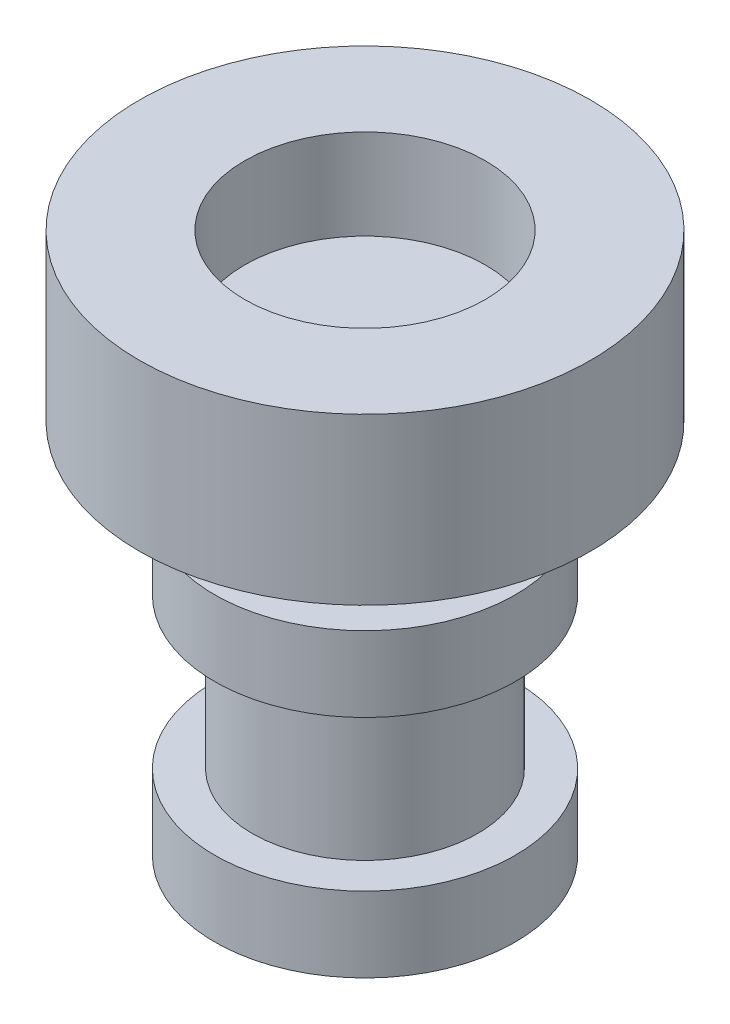
ISO-10303-21;
HEADER;
FILE_DESCRIPTION(('STEP AP214'),'2;1');
FILE_NAME('part.step','',(''),(''),'','','');
FILE_SCHEMA(('AUTOMOTIVE_DESIGN { 1 0 10303 214 1 1 1 1 }'));
ENDSEC;
DATA;
#1=APPLICATION_CONTEXT('core data for automotive mechanical design processes');
#2=APPLICATION_PROTOCOL_DEFINITION('international standard','automotive_design',2000,#1);
#3=PRODUCT_CONTEXT('',#1,'mechanical');
#4=PRODUCT('Part','Part','',(#3));
#5=PRODUCT_RELATED_PRODUCT_CATEGORY('part','',(#4));
#6=PRODUCT_DEFINITION_FORMATION('','',#4);
#7=PRODUCT_DEFINITION_CONTEXT('part definition',#1,'design');
#8=PRODUCT_DEFINITION('design','',#6,#7);
#9=PRODUCT_DEFINITION_SHAPE('','',#8);
#10=(LENGTH_UNIT() NAMED_UNIT(*) SI_UNIT(.MILLI.,.METRE.));
#11=(NAMED_UNIT(*) PLANE_ANGLE_UNIT() SI_UNIT($,.RADIAN.));
#12=(NAMED_UNIT(*) SI_UNIT($,.STERADIAN.) SOLID_ANGLE_UNIT());
#13=UNCERTAINTY_MEASURE_WITH_UNIT(LENGTH_MEASURE(1.E-05),#10,'distance_accuracy_value','');
#14=(GEOMETRIC_REPRESENTATION_CONTEXT(3) GLOBAL_UNCERTAINTY_ASSIGNED_CONTEXT((#13)) GLOBAL_UNIT_ASSIGNED_CONTEXT((#10,
#11,#12)) REPRESENTATION_CONTEXT('',''));
#15=CARTESIAN_POINT('',(0.,0.,0.));
#16=DIRECTION('',(0.,0.,1.));
#17=DIRECTION('',(1.,0.,0.));
#18=AXIS2_PLACEMENT_3D('',#15,#16,#17);
#19=CARTESIAN_POINT('',(-0.522013311509166,-5.,-0.51113803418606));
#20=DIRECTION('',(0.,1.,0.));
#21=DIRECTION('',(0.,0.,1.));
#22=AXIS2_PLACEMENT_3D('',#19,#20,#21);
#23=CYLINDRICAL_SURFACE('',#22,1.5);
#24=CARTESIAN_POINT('',(-0.522013311509166,-2.,-0.51113803418606));
#25=DIRECTION('',(0.,-1.,0.));
#26=DIRECTION('',(0.,0.,-1.));
#27=AXIS2_PLACEMENT_3D('',#24,#25,#26);
#28=CIRCLE('',#27,1.5);
#29=CARTESIAN_POINT('',(-0.522013311509166,-2.,-2.01113803418606));
#30=VERTEX_POINT('',#29);
#31=EDGE_CURVE('E53',#30,#30,#28,.T.);
#32=ORIENTED_EDGE('',*,*,#31,.T.);
#33=EDGE_LOOP('',(#32));
#34=FACE_BOUND('',#33,.T.);
#35=CARTESIAN_POINT('',(-0.522013311509166,-4.,-0.51113803418606));
#36=DIRECTION('',(0.,-1.,0.));
#37=DIRECTION('',(0.,0.,-1.));
#38=AXIS2_PLACEMENT_3D('',#35,#36,#37);
#39=CIRCLE('',#38,1.5);
#40=CARTESIAN_POINT('',(-0.522013311509166,-4.,-2.01113803418606));
#41=VERTEX_POINT('',#40);
#42=EDGE_CURVE('E10',#41,#41,#39,.T.);
#43=ORIENTED_EDGE('',*,*,#42,.F.);
#44=EDGE_LOOP('',(#43));
#45=FACE_BOUND('',#44,.T.);
#46=ADVANCED_FACE('F45',(#34,#45),#23,.T.);
#47=CARTESIAN_POINT('',(-0.522013311509166,2.2,-0.51113803418606));
#48=DIRECTION('',(0.,1.,0.));
#49=DIRECTION('',(0.,0.,1.));
#50=AXIS2_PLACEMENT_3D('',#47,#48,#49);
#51=PLANE('',#50);
#52=CARTESIAN_POINT('',(-0.522013311509166,2.2,-0.51113803418606));
#53=DIRECTION('',(0.,1.,0.));
#54=DIRECTION('',(0.,0.,1.));
#55=AXIS2_PLACEMENT_3D('',#52,#53,#54);
#56=CIRCLE('',#55,3.);
#57=CARTESIAN_POINT('',(-0.522013311509166,2.2,2.48886196581394));
#58=VERTEX_POINT('',#57);
#59=EDGE_CURVE('E88',#58,#58,#56,.T.);
#60=ORIENTED_EDGE('',*,*,#59,.T.);
#61=EDGE_LOOP('',(#60));
#62=FACE_BOUND('',#61,.T.);
#63=CARTESIAN_POINT('',(-0.522013311509166,2.2,-0.51113803418606));
#64=DIRECTION('',(0.,1.,0.));
#65=DIRECTION('',(0.,0.,1.));
#66=AXIS2_PLACEMENT_3D('',#63,#64,#65);
#67=CIRCLE('',#66,1.6);
#68=CARTESIAN_POINT('',(-0.522013311509166,2.2,1.08886196581394));
#69=VERTEX_POINT('',#68);
#70=EDGE_CURVE('E82',#69,#69,#67,.T.);
#71=ORIENTED_EDGE('',*,*,#70,.F.);
#72=EDGE_LOOP('',(#71));
#73=FACE_BOUND('',#72,.T.);
#74=ADVANCED_FACE('F106',(#62,#73),#51,.T.);
#75=CARTESIAN_POINT('',(-0.522013311509166,0.,-0.51113803418606));
#76=DIRECTION('',(0.,1.,0.));
#77=DIRECTION('',(0.,0.,1.));
#78=AXIS2_PLACEMENT_3D('',#75,#76,#77);
#79=PLANE('',#78);
#80=CARTESIAN_POINT('',(-0.522013311509166,0.,-0.51113803418606));
#81=DIRECTION('',(0.,-1.,0.));
#82=DIRECTION('',(0.,0.,-1.));
#83=AXIS2_PLACEMENT_3D('',#80,#81,#82);
#84=CIRCLE('',#83,1.5);
#85=CARTESIAN_POINT('',(-0.522013311509166,0.,-2.01113803418606));
#86=VERTEX_POINT('',#85);
#87=EDGE_CURVE('E58',#86,#86,#84,.T.);
#88=ORIENTED_EDGE('',*,*,#87,.F.);
#89=EDGE_LOOP('',(#88));
#90=FACE_BOUND('',#89,.T.);
#91=CARTESIAN_POINT('',(-0.522013311509166,0.,-0.51113803418606));
#92=DIRECTION('',(0.,1.,0.));
#93=DIRECTION('',(0.,0.,1.));
#94=AXIS2_PLACEMENT_3D('',#91,#92,#93);
#95=CIRCLE('',#94,3.);
#96=CARTESIAN_POINT('',(-0.522013311509166,0.,2.48886196581394));
#97=VERTEX_POINT('',#96);
#98=EDGE_CURVE('E87',#97,#97,#95,.T.);
#99=ORIENTED_EDGE('',*,*,#98,.F.);
#100=EDGE_LOOP('',(#99));
#101=FACE_BOUND('',#100,.T.);
#102=ADVANCED_FACE('F108',(#90,#101),#79,.F.);
#103=CARTESIAN_POINT('',(-0.522013311509166,2.2,-0.51113803418606));
#104=DIRECTION('',(0.,-1.,0.));
#105=DIRECTION('',(0.,0.,-1.));
#106=AXIS2_PLACEMENT_3D('',#103,#104,#105);
#107=CYLINDRICAL_SURFACE('',#106,3.);
#108=ORIENTED_EDGE('',*,*,#59,.F.);
#109=EDGE_LOOP('',(#108));
#110=FACE_BOUND('',#109,.T.);
#111=ORIENTED_EDGE('',*,*,#98,.T.);
#112=EDGE_LOOP('',(#111));
#113=FACE_BOUND('',#112,.T.);
#114=ADVANCED_FACE('F47',(#110,#113),#107,.T.);
#115=CARTESIAN_POINT('',(-0.522013311509166,2.2,-0.51113803418606));
#116=DIRECTION('',(0.,-1.,0.));
#117=DIRECTION('',(0.,0.,-1.));
#118=AXIS2_PLACEMENT_3D('',#115,#116,#117);
#119=CYLINDRICAL_SURFACE('',#118,1.6);
#120=CARTESIAN_POINT('',(-0.522013311509166,1.,-0.51113803418606));
#121=DIRECTION('',(0.,1.,0.));
#122=DIRECTION('',(0.,0.,1.));
#123=AXIS2_PLACEMENT_3D('',#120,#121,#122);
#124=CIRCLE('',#123,1.6);
#125=CARTESIAN_POINT('',(-0.522013311509166,1.,1.08886196581394));
#126=VERTEX_POINT('',#125);
#127=EDGE_CURVE('E64',#126,#126,#124,.T.);
#128=ORIENTED_EDGE('',*,*,#127,.F.);
#129=EDGE_LOOP('',(#128));
#130=FACE_BOUND('',#129,.T.);
#131=ORIENTED_EDGE('',*,*,#70,.T.);
#132=EDGE_LOOP('',(#131));
#133=FACE_BOUND('',#132,.T.);
#134=ADVANCED_FACE('F100',(#130,#133),#119,.F.);
#135=CARTESIAN_POINT('',(0.,1.,0.));
#136=DIRECTION('',(0.,1.,0.));
#137=DIRECTION('',(0.,0.,1.));
#138=AXIS2_PLACEMENT_3D('',#135,#136,#137);
#139=PLANE('',#138);
#140=ORIENTED_EDGE('',*,*,#127,.T.);
#141=EDGE_LOOP('',(#140));
#142=FACE_BOUND('',#141,.T.);
#143=ADVANCED_FACE('F98',(#142),#139,.T.);
#144=CARTESIAN_POINT('',(-0.522013311509166,-1.,-0.51113803418606));
#145=DIRECTION('',(0.,1.,0.));
#146=DIRECTION('',(0.,0.,1.));
#147=AXIS2_PLACEMENT_3D('',#144,#145,#146);
#148=CYLINDRICAL_SURFACE('',#147,1.5);
#149=CARTESIAN_POINT('',(-0.522013311509166,-1.,-0.51113803418606));
#150=DIRECTION('',(0.,-1.,0.));
#151=DIRECTION('',(0.,0.,-1.));
#152=AXIS2_PLACEMENT_3D('',#149,#150,#151);
#153=CIRCLE('',#152,1.5);
#154=CARTESIAN_POINT('',(-0.522013311509166,-1.,-2.01113803418606));
#155=VERTEX_POINT('',#154);
#156=EDGE_CURVE('E74',#155,#155,#153,.T.);
#157=ORIENTED_EDGE('',*,*,#156,.F.);
#158=EDGE_LOOP('',(#157));
#159=FACE_BOUND('',#158,.T.);
#160=ORIENTED_EDGE('',*,*,#87,.T.);
#161=EDGE_LOOP('',(#160));
#162=FACE_BOUND('',#161,.T.);
#163=ADVANCED_FACE('F120',(#159,#162),#148,.T.);
#164=CARTESIAN_POINT('',(-0.522013311509166,-2.,-0.51113803418606));
#165=DIRECTION('',(0.,1.,0.));
#166=DIRECTION('',(0.,0.,1.));
#167=AXIS2_PLACEMENT_3D('',#164,#165,#166);
#168=CYLINDRICAL_SURFACE('',#167,2.);
#169=CARTESIAN_POINT('',(-0.522013311509166,-2.,-0.51113803418606));
#170=DIRECTION('',(0.,-1.,0.));
#171=DIRECTION('',(0.,0.,-1.));
#172=AXIS2_PLACEMENT_3D('',#169,#170,#171);
#173=CIRCLE('',#172,2.);
#174=CARTESIAN_POINT('',(-0.522013311509166,-2.,-2.51113803418606));
#175=VERTEX_POINT('',#174);
#176=EDGE_CURVE('E70',#175,#175,#173,.T.);
#177=ORIENTED_EDGE('',*,*,#176,.F.);
#178=EDGE_LOOP('',(#177));
#179=FACE_BOUND('',#178,.T.);
#180=CARTESIAN_POINT('',(-0.522013311509166,-1.,-0.51113803418606));
#181=DIRECTION('',(0.,-1.,0.));
#182=DIRECTION('',(0.,0.,-1.));
#183=AXIS2_PLACEMENT_3D('',#180,#181,#182);
#184=CIRCLE('',#183,2.);
#185=CARTESIAN_POINT('',(-0.522013311509166,-1.,-2.51113803418606));
#186=VERTEX_POINT('',#185);
#187=EDGE_CURVE('E75',#186,#186,#184,.T.);
#188=ORIENTED_EDGE('',*,*,#187,.T.);
#189=EDGE_LOOP('',(#188));
#190=FACE_BOUND('',#189,.T.);
#191=ADVANCED_FACE('F123',(#179,#190),#168,.T.);
#192=CARTESIAN_POINT('',(-0.522013311509166,-2.,-0.51113803418606));
#193=DIRECTION('',(0.,-1.,0.));
#194=DIRECTION('',(0.,0.,-1.));
#195=AXIS2_PLACEMENT_3D('',#192,#193,#194);
#196=PLANE('',#195);
#197=ORIENTED_EDGE('',*,*,#31,.F.);
#198=EDGE_LOOP('',(#197));
#199=FACE_BOUND('',#198,.T.);
#200=ORIENTED_EDGE('',*,*,#176,.T.);
#201=EDGE_LOOP('',(#200));
#202=FACE_BOUND('',#201,.T.);
#203=ADVANCED_FACE('F127',(#199,#202),#196,.T.);
#204=CARTESIAN_POINT('',(-0.522013311509166,-1.,-0.51113803418606));
#205=DIRECTION('',(0.,-1.,0.));
#206=DIRECTION('',(0.,0.,-1.));
#207=AXIS2_PLACEMENT_3D('',#204,#205,#206);
#208=PLANE('',#207);
#209=ORIENTED_EDGE('',*,*,#156,.T.);
#210=EDGE_LOOP('',(#209));
#211=FACE_BOUND('',#210,.T.);
#212=ORIENTED_EDGE('',*,*,#187,.F.);
#213=EDGE_LOOP('',(#212));
#214=FACE_BOUND('',#213,.T.);
#215=ADVANCED_FACE('F129',(#211,#214),#208,.F.);
#216=CARTESIAN_POINT('',(-0.522013311509166,-4.,-0.51113803418606));
#217=DIRECTION('',(0.,-1.,0.));
#218=DIRECTION('',(0.,0.,-1.));
#219=AXIS2_PLACEMENT_3D('',#216,#217,#218);
#220=CYLINDRICAL_SURFACE('',#219,2.);
#221=CARTESIAN_POINT('',(-0.522013311509166,-4.,-0.51113803418606));
#222=DIRECTION('',(0.,-1.,0.));
#223=DIRECTION('',(0.,0.,-1.));
#224=AXIS2_PLACEMENT_3D('',#221,#222,#223);
#225=CIRCLE('',#224,2.);
#226=CARTESIAN_POINT('',(-0.522013311509166,-4.,-2.51113803418606));
#227=VERTEX_POINT('',#226);
#228=EDGE_CURVE('E79',#227,#227,#225,.T.);
#229=ORIENTED_EDGE('',*,*,#228,.T.);
#230=EDGE_LOOP('',(#229));
#231=FACE_BOUND('',#230,.T.);
#232=CARTESIAN_POINT('',(-0.522013311509166,-5.,-0.51113803418606));
#233=DIRECTION('',(0.,-1.,0.));
#234=DIRECTION('',(0.,0.,-1.));
#235=AXIS2_PLACEMENT_3D('',#232,#233,#234);
#236=CIRCLE('',#235,2.);
#237=CARTESIAN_POINT('',(-0.522013311509166,-5.,-2.51113803418606));
#238=VERTEX_POINT('',#237);
#239=EDGE_CURVE('E68',#238,#238,#236,.T.);
#240=ORIENTED_EDGE('',*,*,#239,.F.);
#241=EDGE_LOOP('',(#240));
#242=FACE_BOUND('',#241,.T.);
#243=ADVANCED_FACE('F132',(#231,#242),#220,.T.);
#244=CARTESIAN_POINT('',(-0.522013311509166,-4.,-0.51113803418606));
#245=DIRECTION('',(0.,-1.,0.));
#246=DIRECTION('',(0.,0.,-1.));
#247=AXIS2_PLACEMENT_3D('',#244,#245,#246);
#248=PLANE('',#247);
#249=ORIENTED_EDGE('',*,*,#42,.T.);
#250=EDGE_LOOP('',(#249));
#251=FACE_BOUND('',#250,.T.);
#252=ORIENTED_EDGE('',*,*,#228,.F.);
#253=EDGE_LOOP('',(#252));
#254=FACE_BOUND('',#253,.T.);
#255=ADVANCED_FACE('F140',(#251,#254),#248,.F.);
#256=CARTESIAN_POINT('',(-0.522013311509166,-5.,-0.51113803418606));
#257=DIRECTION('',(0.,-1.,0.));
#258=DIRECTION('',(0.,0.,-1.));
#259=AXIS2_PLACEMENT_3D('',#256,#257,#258);
#260=PLANE('',#259);
#261=ORIENTED_EDGE('',*,*,#239,.T.);
#262=EDGE_LOOP('',(#261));
#263=FACE_BOUND('',#262,.T.);
#264=ADVANCED_FACE('F137',(#263),#260,.T.);
#265=CLOSED_SHELL('',(#46,#74,#102,#114,#134,#143,#163,#191,#203,#215,#243,#255,#264));
#266=MANIFOLD_SOLID_BREP('B2',#265);
#267=ADVANCED_BREP_SHAPE_REPRESENTATION('',(#18,#266),#14);
#268=SHAPE_DEFINITION_REPRESENTATION(#9,#267);
ENDSEC;
END-ISO-10303-21;
